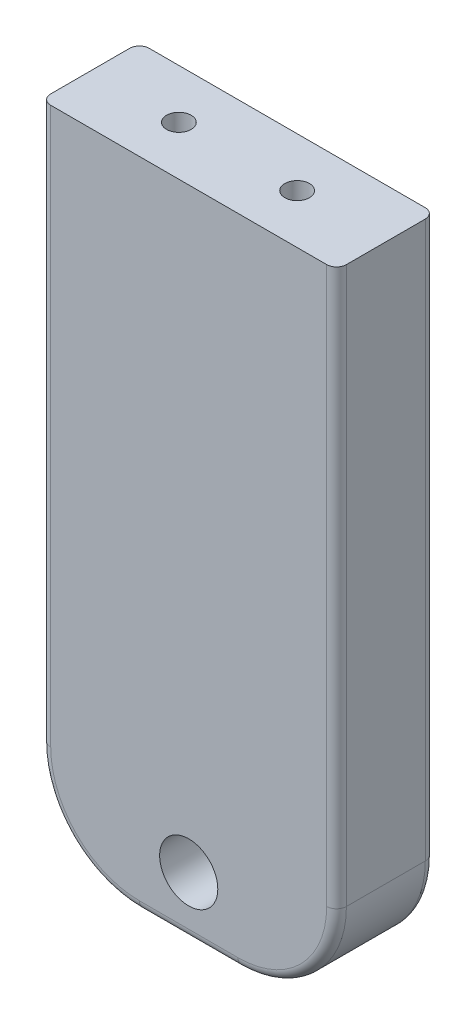
ISO-10303-21;
HEADER;
FILE_DESCRIPTION(('STEP AP214'),'2;1');
FILE_NAME('part.step','',(''),(''),'','','');
FILE_SCHEMA(('AUTOMOTIVE_DESIGN { 1 0 10303 214 1 1 1 1 }'));
ENDSEC;
DATA;
#1=APPLICATION_CONTEXT('core data for automotive mechanical design processes');
#2=APPLICATION_PROTOCOL_DEFINITION('international standard','automotive_design',2000,#1);
#3=PRODUCT_CONTEXT('',#1,'mechanical');
#4=PRODUCT('Part','Part','',(#3));
#5=PRODUCT_RELATED_PRODUCT_CATEGORY('part','',(#4));
#6=PRODUCT_DEFINITION_FORMATION('','',#4);
#7=PRODUCT_DEFINITION_CONTEXT('part definition',#1,'design');
#8=PRODUCT_DEFINITION('design','',#6,#7);
#9=PRODUCT_DEFINITION_SHAPE('','',#8);
#10=(LENGTH_UNIT() NAMED_UNIT(*) SI_UNIT(.MILLI.,.METRE.));
#11=(NAMED_UNIT(*) PLANE_ANGLE_UNIT() SI_UNIT($,.RADIAN.));
#12=(NAMED_UNIT(*) SI_UNIT($,.STERADIAN.) SOLID_ANGLE_UNIT());
#13=UNCERTAINTY_MEASURE_WITH_UNIT(LENGTH_MEASURE(1.E-05),#10,'distance_accuracy_value','');
#14=(GEOMETRIC_REPRESENTATION_CONTEXT(3) GLOBAL_UNCERTAINTY_ASSIGNED_CONTEXT((#13)) GLOBAL_UNIT_ASSIGNED_CONTEXT((#10,
#11,#12)) REPRESENTATION_CONTEXT('',''));
#15=CARTESIAN_POINT('',(0.,0.,0.));
#16=DIRECTION('',(0.,0.,1.));
#17=DIRECTION('',(1.,0.,0.));
#18=AXIS2_PLACEMENT_3D('',#15,#16,#17);
#19=CARTESIAN_POINT('',(-15.,33.2,5.));
#20=DIRECTION('',(1.,0.,0.));
#21=DIRECTION('',(0.,1.,0.));
#22=AXIS2_PLACEMENT_3D('',#19,#20,#21);
#23=PLANE('',#22);
#24=DIRECTION('',(0.,0.,-1.));
#25=VECTOR('',#24,1.);
#26=CARTESIAN_POINT('',(-15.,-23.2,5.));
#27=LINE('',#26,#25);
#28=CARTESIAN_POINT('',(-15.,-23.2,-4.));
#29=VERTEX_POINT('',#28);
#30=CARTESIAN_POINT('',(-15.,-23.2,4.));
#31=VERTEX_POINT('',#30);
#32=EDGE_CURVE('E181',#29,#31,#27,.F.);
#33=ORIENTED_EDGE('',*,*,#32,.T.);
#34=DIRECTION('',(0.,-1.,0.));
#35=VECTOR('',#34,1.);
#36=CARTESIAN_POINT('',(-15.,33.2,4.));
#37=LINE('',#36,#35);
#38=CARTESIAN_POINT('',(-15.,33.2,4.));
#39=VERTEX_POINT('',#38);
#40=EDGE_CURVE('E201',#31,#39,#37,.F.);
#41=ORIENTED_EDGE('',*,*,#40,.T.);
#42=DIRECTION('',(0.,0.,-1.));
#43=VECTOR('',#42,1.);
#44=CARTESIAN_POINT('',(-15.,33.2,5.));
#45=LINE('',#44,#43);
#46=CARTESIAN_POINT('',(-15.,33.2,-4.));
#47=VERTEX_POINT('',#46);
#48=EDGE_CURVE('E167',#39,#47,#45,.T.);
#49=ORIENTED_EDGE('',*,*,#48,.T.);
#50=DIRECTION('',(0.,-1.,0.));
#51=VECTOR('',#50,1.);
#52=CARTESIAN_POINT('',(-15.,33.2,-4.));
#53=LINE('',#52,#51);
#54=EDGE_CURVE('E198',#47,#29,#53,.T.);
#55=ORIENTED_EDGE('',*,*,#54,.T.);
#56=EDGE_LOOP('',(#33,#41,#49,#55));
#57=FACE_BOUND('',#56,.T.);
#58=ADVANCED_FACE('F42',(#57),#23,.F.);
#59=CARTESIAN_POINT('',(-15.,-33.2,5.));
#60=DIRECTION('',(0.,1.,0.));
#61=DIRECTION('',(0.,0.,1.));
#62=AXIS2_PLACEMENT_3D('',#59,#60,#61);
#63=PLANE('',#62);
#64=DIRECTION('',(0.,0.,-1.));
#65=VECTOR('',#64,1.);
#66=CARTESIAN_POINT('',(5.,-33.2,5.));
#67=LINE('',#66,#65);
#68=CARTESIAN_POINT('',(5.,-33.2,-4.));
#69=VERTEX_POINT('',#68);
#70=CARTESIAN_POINT('',(5.,-33.2,4.));
#71=VERTEX_POINT('',#70);
#72=EDGE_CURVE('E175',#69,#71,#67,.F.);
#73=ORIENTED_EDGE('',*,*,#72,.T.);
#74=DIRECTION('',(1.,0.,0.));
#75=VECTOR('',#74,1.);
#76=CARTESIAN_POINT('',(-5.,-33.2,4.));
#77=LINE('',#76,#75);
#78=CARTESIAN_POINT('',(-5.,-33.2,4.));
#79=VERTEX_POINT('',#78);
#80=EDGE_CURVE('E217',#71,#79,#77,.F.);
#81=ORIENTED_EDGE('',*,*,#80,.T.);
#82=DIRECTION('',(0.,0.,-1.));
#83=VECTOR('',#82,1.);
#84=CARTESIAN_POINT('',(-5.,-33.2,5.));
#85=LINE('',#84,#83);
#86=CARTESIAN_POINT('',(-5.,-33.2,-4.));
#87=VERTEX_POINT('',#86);
#88=EDGE_CURVE('E178',#79,#87,#85,.T.);
#89=ORIENTED_EDGE('',*,*,#88,.T.);
#90=DIRECTION('',(1.,0.,0.));
#91=VECTOR('',#90,1.);
#92=CARTESIAN_POINT('',(-15.,-33.2,-4.));
#93=LINE('',#92,#91);
#94=EDGE_CURVE('E215',#87,#69,#93,.T.);
#95=ORIENTED_EDGE('',*,*,#94,.T.);
#96=EDGE_LOOP('',(#73,#81,#89,#95));
#97=FACE_BOUND('',#96,.T.);
#98=ADVANCED_FACE('F282',(#97),#63,.F.);
#99=CARTESIAN_POINT('',(15.,33.2,5.));
#100=DIRECTION('',(1.,0.,0.));
#101=DIRECTION('',(0.,1.,0.));
#102=AXIS2_PLACEMENT_3D('',#99,#100,#101);
#103=PLANE('',#102);
#104=DIRECTION('',(0.,0.,-1.));
#105=VECTOR('',#104,1.);
#106=CARTESIAN_POINT('',(15.,33.2,5.));
#107=LINE('',#106,#105);
#108=CARTESIAN_POINT('',(15.,33.2,4.));
#109=VERTEX_POINT('',#108);
#110=CARTESIAN_POINT('',(15.,33.2,-4.));
#111=VERTEX_POINT('',#110);
#112=EDGE_CURVE('E172',#109,#111,#107,.T.);
#113=ORIENTED_EDGE('',*,*,#112,.F.);
#114=DIRECTION('',(0.,-1.,0.));
#115=VECTOR('',#114,1.);
#116=CARTESIAN_POINT('',(15.,33.2,4.));
#117=LINE('',#116,#115);
#118=CARTESIAN_POINT('',(15.,-23.2,4.));
#119=VERTEX_POINT('',#118);
#120=EDGE_CURVE('E11',#109,#119,#117,.T.);
#121=ORIENTED_EDGE('',*,*,#120,.T.);
#122=DIRECTION('',(0.,0.,-1.));
#123=VECTOR('',#122,1.);
#124=CARTESIAN_POINT('',(15.,-23.2,-5.));
#125=LINE('',#124,#123);
#126=CARTESIAN_POINT('',(15.,-23.2,-4.));
#127=VERTEX_POINT('',#126);
#128=EDGE_CURVE('E184',#119,#127,#125,.T.);
#129=ORIENTED_EDGE('',*,*,#128,.T.);
#130=DIRECTION('',(0.,-1.,0.));
#131=VECTOR('',#130,1.);
#132=CARTESIAN_POINT('',(15.,33.2,-4.));
#133=LINE('',#132,#131);
#134=EDGE_CURVE('E51',#127,#111,#133,.F.);
#135=ORIENTED_EDGE('',*,*,#134,.T.);
#136=EDGE_LOOP('',(#113,#121,#129,#135));
#137=FACE_BOUND('',#136,.T.);
#138=ADVANCED_FACE('F263',(#137),#103,.T.);
#139=CARTESIAN_POINT('',(-15.,33.2,5.));
#140=DIRECTION('',(0.,1.,0.));
#141=DIRECTION('',(0.,0.,1.));
#142=AXIS2_PLACEMENT_3D('',#139,#140,#141);
#143=PLANE('',#142);
#144=CARTESIAN_POINT('',(-6.,33.2,0.));
#145=DIRECTION('',(0.,1.,0.));
#146=DIRECTION('',(0.,0.,1.));
#147=AXIS2_PLACEMENT_3D('',#144,#145,#146);
#148=CIRCLE('',#147,1.24999999999999);
#149=CARTESIAN_POINT('',(-6.,33.2,1.24999999999999));
#150=VERTEX_POINT('',#149);
#151=EDGE_CURVE('E146',#150,#150,#148,.T.);
#152=ORIENTED_EDGE('',*,*,#151,.F.);
#153=EDGE_LOOP('',(#152));
#154=FACE_BOUND('',#153,.T.);
#155=CARTESIAN_POINT('',(6.,33.2,0.));
#156=DIRECTION('',(0.,1.,0.));
#157=DIRECTION('',(0.,0.,1.));
#158=AXIS2_PLACEMENT_3D('',#155,#156,#157);
#159=CIRCLE('',#158,1.24999999999999);
#160=CARTESIAN_POINT('',(6.,33.2,1.24999999999999));
#161=VERTEX_POINT('',#160);
#162=EDGE_CURVE('E145',#161,#161,#159,.T.);
#163=ORIENTED_EDGE('',*,*,#162,.F.);
#164=EDGE_LOOP('',(#163));
#165=FACE_BOUND('',#164,.T.);
#166=ORIENTED_EDGE('',*,*,#48,.F.);
#167=CARTESIAN_POINT('',(-14.,33.2,4.));
#168=DIRECTION('',(0.,1.,0.));
#169=DIRECTION('',(0.,0.,1.));
#170=AXIS2_PLACEMENT_3D('',#167,#168,#169);
#171=CIRCLE('',#170,1.);
#172=CARTESIAN_POINT('',(-14.,33.2,5.));
#173=VERTEX_POINT('',#172);
#174=EDGE_CURVE('E209',#39,#173,#171,.T.);
#175=ORIENTED_EDGE('',*,*,#174,.T.);
#176=DIRECTION('',(1.,0.,0.));
#177=VECTOR('',#176,1.);
#178=CARTESIAN_POINT('',(-15.,33.2,5.));
#179=LINE('',#178,#177);
#180=CARTESIAN_POINT('',(14.,33.2,5.));
#181=VERTEX_POINT('',#180);
#182=EDGE_CURVE('E164',#173,#181,#179,.T.);
#183=ORIENTED_EDGE('',*,*,#182,.T.);
#184=CARTESIAN_POINT('',(14.,33.2,4.));
#185=DIRECTION('',(0.,1.,0.));
#186=DIRECTION('',(0.,0.,1.));
#187=AXIS2_PLACEMENT_3D('',#184,#185,#186);
#188=CIRCLE('',#187,1.);
#189=EDGE_CURVE('E205',#181,#109,#188,.T.);
#190=ORIENTED_EDGE('',*,*,#189,.T.);
#191=ORIENTED_EDGE('',*,*,#112,.T.);
#192=CARTESIAN_POINT('',(14.,33.2,-4.));
#193=DIRECTION('',(0.,1.,0.));
#194=DIRECTION('',(0.,0.,1.));
#195=AXIS2_PLACEMENT_3D('',#192,#193,#194);
#196=CIRCLE('',#195,1.);
#197=CARTESIAN_POINT('',(14.,33.2,-5.));
#198=VERTEX_POINT('',#197);
#199=EDGE_CURVE('E203',#111,#198,#196,.T.);
#200=ORIENTED_EDGE('',*,*,#199,.T.);
#201=DIRECTION('',(1.,0.,0.));
#202=VECTOR('',#201,1.);
#203=CARTESIAN_POINT('',(-15.,33.2,-5.));
#204=LINE('',#203,#202);
#205=CARTESIAN_POINT('',(-14.,33.2,-5.));
#206=VERTEX_POINT('',#205);
#207=EDGE_CURVE('E163',#206,#198,#204,.T.);
#208=ORIENTED_EDGE('',*,*,#207,.F.);
#209=CARTESIAN_POINT('',(-14.,33.2,-4.));
#210=DIRECTION('',(0.,1.,0.));
#211=DIRECTION('',(0.,0.,1.));
#212=AXIS2_PLACEMENT_3D('',#209,#210,#211);
#213=CIRCLE('',#212,1.);
#214=EDGE_CURVE('E207',#206,#47,#213,.T.);
#215=ORIENTED_EDGE('',*,*,#214,.T.);
#216=EDGE_LOOP('',(#166,#175,#183,#190,#191,#200,#208,#215));
#217=FACE_BOUND('',#216,.T.);
#218=ADVANCED_FACE('F268',(#154,#165,#217),#143,.T.);
#219=CARTESIAN_POINT('',(0.,0.,5.));
#220=DIRECTION('',(0.,0.,1.));
#221=DIRECTION('',(1.,0.,0.));
#222=AXIS2_PLACEMENT_3D('',#219,#220,#221);
#223=PLANE('',#222);
#224=CARTESIAN_POINT('',(0.,-27.2,5.));
#225=DIRECTION('',(0.,0.,1.));
#226=DIRECTION('',(1.,0.,0.));
#227=AXIS2_PLACEMENT_3D('',#224,#225,#226);
#228=CIRCLE('',#227,2.95);
#229=CARTESIAN_POINT('',(2.95,-27.2,5.));
#230=VERTEX_POINT('',#229);
#231=EDGE_CURVE('E157',#230,#230,#228,.T.);
#232=ORIENTED_EDGE('',*,*,#231,.F.);
#233=EDGE_LOOP('',(#232));
#234=FACE_BOUND('',#233,.T.);
#235=ORIENTED_EDGE('',*,*,#182,.F.);
#236=DIRECTION('',(0.,-1.,0.));
#237=VECTOR('',#236,1.);
#238=CARTESIAN_POINT('',(-14.,-23.2,5.));
#239=LINE('',#238,#237);
#240=CARTESIAN_POINT('',(-14.,-23.2,5.));
#241=VERTEX_POINT('',#240);
#242=EDGE_CURVE('E195',#173,#241,#239,.T.);
#243=ORIENTED_EDGE('',*,*,#242,.T.);
#244=CARTESIAN_POINT('',(-5.,-23.2,5.));
#245=DIRECTION('',(0.,0.,1.));
#246=DIRECTION('',(1.,0.,0.));
#247=AXIS2_PLACEMENT_3D('',#244,#245,#246);
#248=CIRCLE('',#247,9.);
#249=CARTESIAN_POINT('',(-5.,-32.2,5.));
#250=VERTEX_POINT('',#249);
#251=EDGE_CURVE('E193',#241,#250,#248,.T.);
#252=ORIENTED_EDGE('',*,*,#251,.T.);
#253=DIRECTION('',(1.,0.,0.));
#254=VECTOR('',#253,1.);
#255=CARTESIAN_POINT('',(5.,-32.2,5.));
#256=LINE('',#255,#254);
#257=CARTESIAN_POINT('',(5.,-32.2,5.));
#258=VERTEX_POINT('',#257);
#259=EDGE_CURVE('E191',#250,#258,#256,.T.);
#260=ORIENTED_EDGE('',*,*,#259,.T.);
#261=CARTESIAN_POINT('',(5.,-23.2,5.));
#262=DIRECTION('',(0.,0.,1.));
#263=DIRECTION('',(1.,0.,0.));
#264=AXIS2_PLACEMENT_3D('',#261,#262,#263);
#265=CIRCLE('',#264,9.);
#266=CARTESIAN_POINT('',(14.,-23.2,5.));
#267=VERTEX_POINT('',#266);
#268=EDGE_CURVE('E189',#258,#267,#265,.T.);
#269=ORIENTED_EDGE('',*,*,#268,.T.);
#270=DIRECTION('',(0.,-1.,0.));
#271=VECTOR('',#270,1.);
#272=CARTESIAN_POINT('',(14.,0.,5.));
#273=LINE('',#272,#271);
#274=EDGE_CURVE('E187',#267,#181,#273,.F.);
#275=ORIENTED_EDGE('',*,*,#274,.T.);
#276=EDGE_LOOP('',(#235,#243,#252,#260,#269,#275));
#277=FACE_BOUND('',#276,.T.);
#278=ADVANCED_FACE('F308',(#234,#277),#223,.T.);
#279=CARTESIAN_POINT('',(0.,0.,-5.));
#280=DIRECTION('',(0.,0.,1.));
#281=DIRECTION('',(1.,0.,0.));
#282=AXIS2_PLACEMENT_3D('',#279,#280,#281);
#283=PLANE('',#282);
#284=CARTESIAN_POINT('',(0.,-27.2,-5.));
#285=DIRECTION('',(0.,0.,1.));
#286=DIRECTION('',(1.,0.,0.));
#287=AXIS2_PLACEMENT_3D('',#284,#285,#286);
#288=CIRCLE('',#287,2.95);
#289=CARTESIAN_POINT('',(2.95,-27.2,-5.));
#290=VERTEX_POINT('',#289);
#291=EDGE_CURVE('E160',#290,#290,#288,.T.);
#292=ORIENTED_EDGE('',*,*,#291,.T.);
#293=EDGE_LOOP('',(#292));
#294=FACE_BOUND('',#293,.T.);
#295=CARTESIAN_POINT('',(-5.,-23.2,-5.));
#296=DIRECTION('',(0.,0.,1.));
#297=DIRECTION('',(1.,0.,0.));
#298=AXIS2_PLACEMENT_3D('',#295,#296,#297);
#299=CIRCLE('',#298,9.);
#300=CARTESIAN_POINT('',(-5.,-32.2,-5.));
#301=VERTEX_POINT('',#300);
#302=CARTESIAN_POINT('',(-14.,-23.2,-5.));
#303=VERTEX_POINT('',#302);
#304=EDGE_CURVE('E59',#301,#303,#299,.F.);
#305=ORIENTED_EDGE('',*,*,#304,.T.);
#306=DIRECTION('',(0.,-1.,0.));
#307=VECTOR('',#306,1.);
#308=CARTESIAN_POINT('',(-14.,0.,-5.));
#309=LINE('',#308,#307);
#310=EDGE_CURVE('E229',#303,#206,#309,.F.);
#311=ORIENTED_EDGE('',*,*,#310,.T.);
#312=ORIENTED_EDGE('',*,*,#207,.T.);
#313=DIRECTION('',(0.,-1.,0.));
#314=VECTOR('',#313,1.);
#315=CARTESIAN_POINT('',(14.,-23.2,-5.));
#316=LINE('',#315,#314);
#317=CARTESIAN_POINT('',(14.,-23.2,-5.));
#318=VERTEX_POINT('',#317);
#319=EDGE_CURVE('E223',#198,#318,#316,.T.);
#320=ORIENTED_EDGE('',*,*,#319,.T.);
#321=CARTESIAN_POINT('',(5.,-23.2,-5.));
#322=DIRECTION('',(0.,0.,1.));
#323=DIRECTION('',(1.,0.,0.));
#324=AXIS2_PLACEMENT_3D('',#321,#322,#323);
#325=CIRCLE('',#324,9.);
#326=CARTESIAN_POINT('',(5.,-32.2,-5.));
#327=VERTEX_POINT('',#326);
#328=EDGE_CURVE('E225',#318,#327,#325,.F.);
#329=ORIENTED_EDGE('',*,*,#328,.T.);
#330=DIRECTION('',(1.,0.,0.));
#331=VECTOR('',#330,1.);
#332=CARTESIAN_POINT('',(0.,-32.2,-5.));
#333=LINE('',#332,#331);
#334=EDGE_CURVE('E64',#327,#301,#333,.F.);
#335=ORIENTED_EDGE('',*,*,#334,.T.);
#336=EDGE_LOOP('',(#305,#311,#312,#320,#329,#335));
#337=FACE_BOUND('',#336,.T.);
#338=ADVANCED_FACE('F310',(#294,#337),#283,.F.);
#339=CARTESIAN_POINT('',(0.,-27.2,5.));
#340=DIRECTION('',(0.,0.,1.));
#341=DIRECTION('',(1.,0.,0.));
#342=AXIS2_PLACEMENT_3D('',#339,#340,#341);
#343=CYLINDRICAL_SURFACE('',#342,2.95);
#344=ORIENTED_EDGE('',*,*,#291,.F.);
#345=EDGE_LOOP('',(#344));
#346=FACE_BOUND('',#345,.T.);
#347=ORIENTED_EDGE('',*,*,#231,.T.);
#348=EDGE_LOOP('',(#347));
#349=FACE_BOUND('',#348,.T.);
#350=ADVANCED_FACE('F317',(#346,#349),#343,.F.);
#351=CARTESIAN_POINT('',(6.,12.2,0.));
#352=DIRECTION('',(0.,1.,0.));
#353=DIRECTION('',(0.,0.,1.));
#354=AXIS2_PLACEMENT_3D('',#351,#352,#353);
#355=CONICAL_SURFACE('',#354,1.25,1.02974425867665);
#356=CARTESIAN_POINT('',(5.99999999999999,11.4489242262155,0.));
#357=VERTEX_POINT('',#356);
#358=VERTEX_LOOP('',#357);
#359=FACE_BOUND('',#358,.T.);
#360=CARTESIAN_POINT('',(6.,12.2,0.));
#361=DIRECTION('',(0.,1.,0.));
#362=DIRECTION('',(0.,0.,1.));
#363=AXIS2_PLACEMENT_3D('',#360,#361,#362);
#364=CIRCLE('',#363,1.25);
#365=CARTESIAN_POINT('',(6.,12.2,1.25));
#366=VERTEX_POINT('',#365);
#367=EDGE_CURVE('E149',#366,#366,#364,.T.);
#368=ORIENTED_EDGE('',*,*,#367,.T.);
#369=EDGE_LOOP('',(#368));
#370=FACE_BOUND('',#369,.T.);
#371=ADVANCED_FACE('F409',(#359,#370),#355,.F.);
#372=CARTESIAN_POINT('',(6.,33.2,0.));
#373=DIRECTION('',(0.,1.,0.));
#374=DIRECTION('',(0.,0.,1.));
#375=AXIS2_PLACEMENT_3D('',#372,#373,#374);
#376=CYLINDRICAL_SURFACE('',#375,1.24999999999999);
#377=ORIENTED_EDGE('',*,*,#367,.F.);
#378=EDGE_LOOP('',(#377));
#379=FACE_BOUND('',#378,.T.);
#380=ORIENTED_EDGE('',*,*,#162,.T.);
#381=EDGE_LOOP('',(#380));
#382=FACE_BOUND('',#381,.T.);
#383=ADVANCED_FACE('F139',(#379,#382),#376,.F.);
#384=CARTESIAN_POINT('',(-6.,12.2,0.));
#385=DIRECTION('',(0.,1.,0.));
#386=DIRECTION('',(0.,0.,1.));
#387=AXIS2_PLACEMENT_3D('',#384,#385,#386);
#388=CONICAL_SURFACE('',#387,1.25,1.02974425867665);
#389=CARTESIAN_POINT('',(-6.00000000000001,11.4489242262155,0.));
#390=VERTEX_POINT('',#389);
#391=VERTEX_LOOP('',#390);
#392=FACE_BOUND('',#391,.T.);
#393=CARTESIAN_POINT('',(-6.,12.2,0.));
#394=DIRECTION('',(0.,1.,0.));
#395=DIRECTION('',(0.,0.,1.));
#396=AXIS2_PLACEMENT_3D('',#393,#394,#395);
#397=CIRCLE('',#396,1.25);
#398=CARTESIAN_POINT('',(-6.,12.2,1.25));
#399=VERTEX_POINT('',#398);
#400=EDGE_CURVE('E143',#399,#399,#397,.T.);
#401=ORIENTED_EDGE('',*,*,#400,.T.);
#402=EDGE_LOOP('',(#401));
#403=FACE_BOUND('',#402,.T.);
#404=ADVANCED_FACE('F135',(#392,#403),#388,.F.);
#405=CARTESIAN_POINT('',(-6.,33.2,0.));
#406=DIRECTION('',(0.,1.,0.));
#407=DIRECTION('',(0.,0.,1.));
#408=AXIS2_PLACEMENT_3D('',#405,#406,#407);
#409=CYLINDRICAL_SURFACE('',#408,1.24999999999999);
#410=ORIENTED_EDGE('',*,*,#400,.F.);
#411=EDGE_LOOP('',(#410));
#412=FACE_BOUND('',#411,.T.);
#413=ORIENTED_EDGE('',*,*,#151,.T.);
#414=EDGE_LOOP('',(#413));
#415=FACE_BOUND('',#414,.T.);
#416=ADVANCED_FACE('F138',(#412,#415),#409,.F.);
#417=CARTESIAN_POINT('',(-5.,-23.2,5.));
#418=DIRECTION('',(0.,0.,-1.));
#419=DIRECTION('',(-1.,0.,0.));
#420=AXIS2_PLACEMENT_3D('',#417,#418,#419);
#421=CYLINDRICAL_SURFACE('',#420,10.);
#422=ORIENTED_EDGE('',*,*,#88,.F.);
#423=CARTESIAN_POINT('',(-5.,-23.2,4.));
#424=DIRECTION('',(0.,0.,1.));
#425=DIRECTION('',(1.,0.,0.));
#426=AXIS2_PLACEMENT_3D('',#423,#424,#425);
#427=CIRCLE('',#426,10.);
#428=EDGE_CURVE('E213',#79,#31,#427,.F.);
#429=ORIENTED_EDGE('',*,*,#428,.T.);
#430=ORIENTED_EDGE('',*,*,#32,.F.);
#431=CARTESIAN_POINT('',(-5.,-23.2,-4.));
#432=DIRECTION('',(0.,0.,1.));
#433=DIRECTION('',(1.,0.,0.));
#434=AXIS2_PLACEMENT_3D('',#431,#432,#433);
#435=CIRCLE('',#434,10.);
#436=EDGE_CURVE('E211',#29,#87,#435,.T.);
#437=ORIENTED_EDGE('',*,*,#436,.T.);
#438=EDGE_LOOP('',(#422,#429,#430,#437));
#439=FACE_BOUND('',#438,.T.);
#440=ADVANCED_FACE('F299',(#439),#421,.T.);
#441=CARTESIAN_POINT('',(5.,-23.2,5.));
#442=DIRECTION('',(0.,0.,1.));
#443=DIRECTION('',(1.,0.,0.));
#444=AXIS2_PLACEMENT_3D('',#441,#442,#443);
#445=CYLINDRICAL_SURFACE('',#444,10.);
#446=ORIENTED_EDGE('',*,*,#128,.F.);
#447=CARTESIAN_POINT('',(5.,-23.2,4.));
#448=DIRECTION('',(0.,0.,1.));
#449=DIRECTION('',(1.,0.,0.));
#450=AXIS2_PLACEMENT_3D('',#447,#448,#449);
#451=CIRCLE('',#450,10.);
#452=EDGE_CURVE('E221',#119,#71,#451,.F.);
#453=ORIENTED_EDGE('',*,*,#452,.T.);
#454=ORIENTED_EDGE('',*,*,#72,.F.);
#455=CARTESIAN_POINT('',(5.,-23.2,-4.));
#456=DIRECTION('',(0.,0.,1.));
#457=DIRECTION('',(1.,0.,0.));
#458=AXIS2_PLACEMENT_3D('',#455,#456,#457);
#459=CIRCLE('',#458,10.);
#460=EDGE_CURVE('E219',#69,#127,#459,.T.);
#461=ORIENTED_EDGE('',*,*,#460,.T.);
#462=EDGE_LOOP('',(#446,#453,#454,#461));
#463=FACE_BOUND('',#462,.T.);
#464=ADVANCED_FACE('F278',(#463),#445,.T.);
#465=CARTESIAN_POINT('',(14.,33.2,4.));
#466=DIRECTION('',(0.,-1.,0.));
#467=DIRECTION('',(1.,0.,0.));
#468=AXIS2_PLACEMENT_3D('',#465,#466,#467);
#469=CYLINDRICAL_SURFACE('',#468,1.);
#470=ORIENTED_EDGE('',*,*,#189,.F.);
#471=ORIENTED_EDGE('',*,*,#274,.F.);
#472=CARTESIAN_POINT('',(14.,-23.2,4.));
#473=DIRECTION('',(0.,-1.,0.));
#474=DIRECTION('',(0.,0.,-1.));
#475=AXIS2_PLACEMENT_3D('',#472,#473,#474);
#476=CIRCLE('',#475,1.);
#477=EDGE_CURVE('E152',#119,#267,#476,.T.);
#478=ORIENTED_EDGE('',*,*,#477,.F.);
#479=ORIENTED_EDGE('',*,*,#120,.F.);
#480=EDGE_LOOP('',(#470,#471,#478,#479));
#481=FACE_BOUND('',#480,.T.);
#482=ADVANCED_FACE('F274',(#481),#469,.T.);
#483=CARTESIAN_POINT('',(5.,-23.2,4.));
#484=DIRECTION('',(0.,0.,1.));
#485=DIRECTION('',(1.,0.,0.));
#486=AXIS2_PLACEMENT_3D('',#483,#484,#485);
#487=TOROIDAL_SURFACE('',#486,9.,1.);
#488=ORIENTED_EDGE('',*,*,#477,.T.);
#489=ORIENTED_EDGE('',*,*,#268,.F.);
#490=CARTESIAN_POINT('',(5.,-32.2,4.));
#491=DIRECTION('',(-1.,0.,0.));
#492=DIRECTION('',(0.,0.,1.));
#493=AXIS2_PLACEMENT_3D('',#490,#491,#492);
#494=CIRCLE('',#493,1.);
#495=EDGE_CURVE('E237',#71,#258,#494,.T.);
#496=ORIENTED_EDGE('',*,*,#495,.F.);
#497=ORIENTED_EDGE('',*,*,#452,.F.);
#498=EDGE_LOOP('',(#488,#489,#496,#497));
#499=FACE_BOUND('',#498,.T.);
#500=ADVANCED_FACE('F287',(#499),#487,.T.);
#501=CARTESIAN_POINT('',(0.,-32.2,4.));
#502=DIRECTION('',(-1.,0.,0.));
#503=DIRECTION('',(0.,0.,1.));
#504=AXIS2_PLACEMENT_3D('',#501,#502,#503);
#505=CYLINDRICAL_SURFACE('',#504,1.);
#506=ORIENTED_EDGE('',*,*,#495,.T.);
#507=ORIENTED_EDGE('',*,*,#259,.F.);
#508=CARTESIAN_POINT('',(-5.,-32.2,4.));
#509=DIRECTION('',(-1.,0.,0.));
#510=DIRECTION('',(0.,0.,1.));
#511=AXIS2_PLACEMENT_3D('',#508,#509,#510);
#512=CIRCLE('',#511,1.);
#513=EDGE_CURVE('E234',#79,#250,#512,.T.);
#514=ORIENTED_EDGE('',*,*,#513,.F.);
#515=ORIENTED_EDGE('',*,*,#80,.F.);
#516=EDGE_LOOP('',(#506,#507,#514,#515));
#517=FACE_BOUND('',#516,.T.);
#518=ADVANCED_FACE('F291',(#517),#505,.T.);
#519=CARTESIAN_POINT('',(-5.,-23.2,4.));
#520=DIRECTION('',(0.,0.,1.));
#521=DIRECTION('',(1.,0.,0.));
#522=AXIS2_PLACEMENT_3D('',#519,#520,#521);
#523=TOROIDAL_SURFACE('',#522,9.,1.);
#524=ORIENTED_EDGE('',*,*,#513,.T.);
#525=ORIENTED_EDGE('',*,*,#251,.F.);
#526=CARTESIAN_POINT('',(-14.,-23.2,4.));
#527=DIRECTION('',(0.,1.,0.));
#528=DIRECTION('',(0.,0.,1.));
#529=AXIS2_PLACEMENT_3D('',#526,#527,#528);
#530=CIRCLE('',#529,1.);
#531=EDGE_CURVE('E232',#31,#241,#530,.T.);
#532=ORIENTED_EDGE('',*,*,#531,.F.);
#533=ORIENTED_EDGE('',*,*,#428,.F.);
#534=EDGE_LOOP('',(#524,#525,#532,#533));
#535=FACE_BOUND('',#534,.T.);
#536=ADVANCED_FACE('F296',(#535),#523,.T.);
#537=CARTESIAN_POINT('',(-14.,0.,4.));
#538=DIRECTION('',(0.,1.,0.));
#539=DIRECTION('',(-1.,0.,0.));
#540=AXIS2_PLACEMENT_3D('',#537,#538,#539);
#541=CYLINDRICAL_SURFACE('',#540,1.);
#542=ORIENTED_EDGE('',*,*,#174,.F.);
#543=ORIENTED_EDGE('',*,*,#40,.F.);
#544=ORIENTED_EDGE('',*,*,#531,.T.);
#545=ORIENTED_EDGE('',*,*,#242,.F.);
#546=EDGE_LOOP('',(#542,#543,#544,#545));
#547=FACE_BOUND('',#546,.T.);
#548=ADVANCED_FACE('F305',(#547),#541,.T.);
#549=CARTESIAN_POINT('',(14.,0.,-4.));
#550=DIRECTION('',(0.,1.,0.));
#551=DIRECTION('',(-1.,0.,0.));
#552=AXIS2_PLACEMENT_3D('',#549,#550,#551);
#553=CYLINDRICAL_SURFACE('',#552,1.);
#554=ORIENTED_EDGE('',*,*,#199,.F.);
#555=ORIENTED_EDGE('',*,*,#134,.F.);
#556=CARTESIAN_POINT('',(14.,-23.2,-4.));
#557=DIRECTION('',(0.,-1.,0.));
#558=DIRECTION('',(0.,0.,-1.));
#559=AXIS2_PLACEMENT_3D('',#556,#557,#558);
#560=CIRCLE('',#559,1.);
#561=EDGE_CURVE('E46',#318,#127,#560,.T.);
#562=ORIENTED_EDGE('',*,*,#561,.F.);
#563=ORIENTED_EDGE('',*,*,#319,.F.);
#564=EDGE_LOOP('',(#554,#555,#562,#563));
#565=FACE_BOUND('',#564,.T.);
#566=ADVANCED_FACE('F44',(#565),#553,.T.);
#567=CARTESIAN_POINT('',(5.,-23.2,-4.));
#568=DIRECTION('',(0.,0.,1.));
#569=DIRECTION('',(1.,0.,0.));
#570=AXIS2_PLACEMENT_3D('',#567,#568,#569);
#571=TOROIDAL_SURFACE('',#570,9.,1.);
#572=ORIENTED_EDGE('',*,*,#561,.T.);
#573=ORIENTED_EDGE('',*,*,#460,.F.);
#574=CARTESIAN_POINT('',(5.,-32.2,-4.));
#575=DIRECTION('',(-1.,0.,0.));
#576=DIRECTION('',(0.,0.,1.));
#577=AXIS2_PLACEMENT_3D('',#574,#575,#576);
#578=CIRCLE('',#577,1.);
#579=EDGE_CURVE('E246',#327,#69,#578,.T.);
#580=ORIENTED_EDGE('',*,*,#579,.F.);
#581=ORIENTED_EDGE('',*,*,#328,.F.);
#582=EDGE_LOOP('',(#572,#573,#580,#581));
#583=FACE_BOUND('',#582,.T.);
#584=ADVANCED_FACE('F256',(#583),#571,.T.);
#585=CARTESIAN_POINT('',(-15.,-32.2,-4.));
#586=DIRECTION('',(1.,0.,0.));
#587=DIRECTION('',(0.,0.,-1.));
#588=AXIS2_PLACEMENT_3D('',#585,#586,#587);
#589=CYLINDRICAL_SURFACE('',#588,1.);
#590=ORIENTED_EDGE('',*,*,#579,.T.);
#591=ORIENTED_EDGE('',*,*,#94,.F.);
#592=CARTESIAN_POINT('',(-5.,-32.2,-4.));
#593=DIRECTION('',(-1.,0.,0.));
#594=DIRECTION('',(0.,0.,1.));
#595=AXIS2_PLACEMENT_3D('',#592,#593,#594);
#596=CIRCLE('',#595,1.);
#597=EDGE_CURVE('E244',#301,#87,#596,.T.);
#598=ORIENTED_EDGE('',*,*,#597,.F.);
#599=ORIENTED_EDGE('',*,*,#334,.F.);
#600=EDGE_LOOP('',(#590,#591,#598,#599));
#601=FACE_BOUND('',#600,.T.);
#602=ADVANCED_FACE('F353',(#601),#589,.T.);
#603=CARTESIAN_POINT('',(-5.,-23.2,-4.));
#604=DIRECTION('',(0.,0.,1.));
#605=DIRECTION('',(1.,0.,0.));
#606=AXIS2_PLACEMENT_3D('',#603,#604,#605);
#607=TOROIDAL_SURFACE('',#606,9.,1.);
#608=ORIENTED_EDGE('',*,*,#597,.T.);
#609=ORIENTED_EDGE('',*,*,#436,.F.);
#610=CARTESIAN_POINT('',(-14.,-23.2,-4.));
#611=DIRECTION('',(0.,1.,0.));
#612=DIRECTION('',(0.,0.,1.));
#613=AXIS2_PLACEMENT_3D('',#610,#611,#612);
#614=CIRCLE('',#613,1.);
#615=EDGE_CURVE('E242',#303,#29,#614,.T.);
#616=ORIENTED_EDGE('',*,*,#615,.F.);
#617=ORIENTED_EDGE('',*,*,#304,.F.);
#618=EDGE_LOOP('',(#608,#609,#616,#617));
#619=FACE_BOUND('',#618,.T.);
#620=ADVANCED_FACE('F349',(#619),#607,.T.);
#621=CARTESIAN_POINT('',(-14.,33.2,-4.));
#622=DIRECTION('',(0.,-1.,0.));
#623=DIRECTION('',(1.,0.,0.));
#624=AXIS2_PLACEMENT_3D('',#621,#622,#623);
#625=CYLINDRICAL_SURFACE('',#624,1.);
#626=ORIENTED_EDGE('',*,*,#214,.F.);
#627=ORIENTED_EDGE('',*,*,#310,.F.);
#628=ORIENTED_EDGE('',*,*,#615,.T.);
#629=ORIENTED_EDGE('',*,*,#54,.F.);
#630=EDGE_LOOP('',(#626,#627,#628,#629));
#631=FACE_BOUND('',#630,.T.);
#632=ADVANCED_FACE('F346',(#631),#625,.T.);
#633=CLOSED_SHELL('',(#58,#98,#138,#218,#278,#338,#350,#371,#383,#404,#416,#440,#464,#482,#500,
#518,#536,#548,#566,#584,#602,#620,#632));
#634=MANIFOLD_SOLID_BREP('B2',#633);
#635=ADVANCED_BREP_SHAPE_REPRESENTATION('',(#18,#634),#14);
#636=SHAPE_DEFINITION_REPRESENTATION(#9,#635);
ENDSEC;
END-ISO-10303-21;
